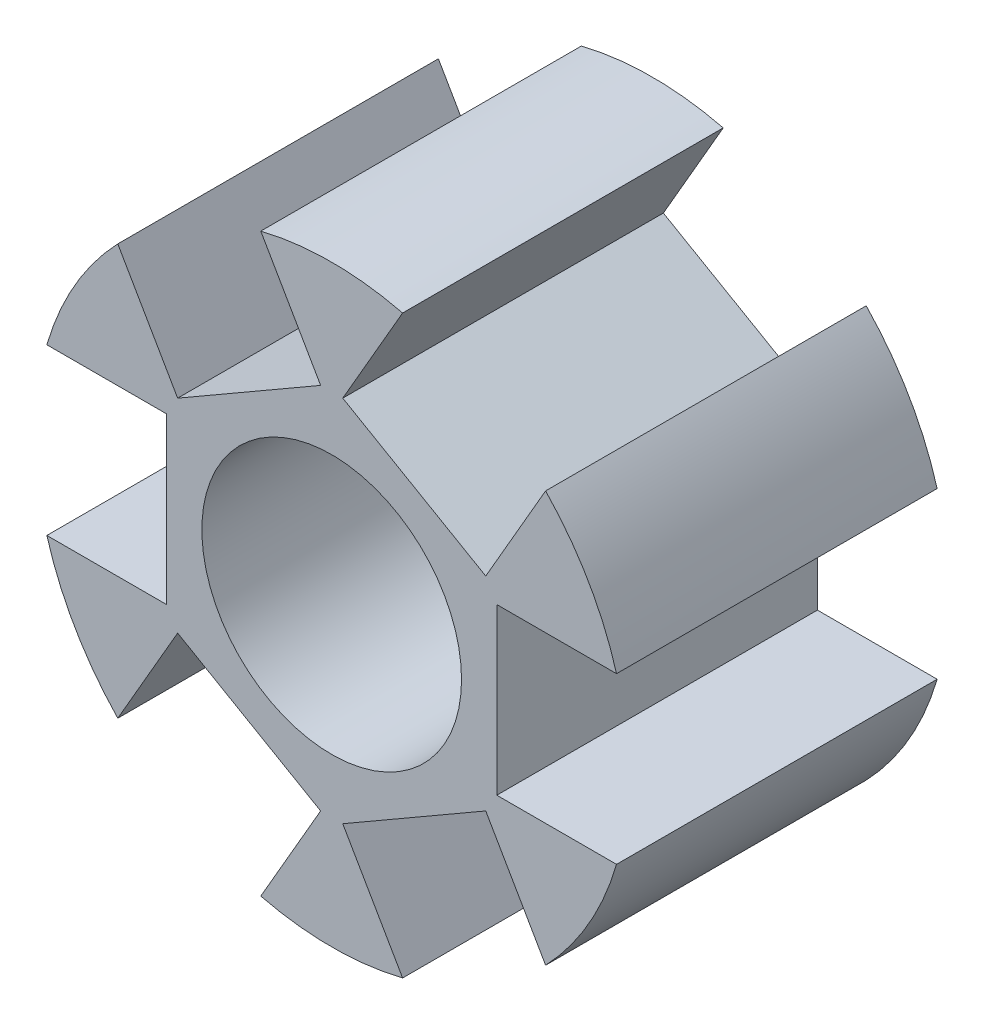
ISO-10303-21;
HEADER;
FILE_DESCRIPTION(('STEP AP214'),'2;1');
FILE_NAME('part.step','',(''),(''),'','','');
FILE_SCHEMA(('AUTOMOTIVE_DESIGN { 1 0 10303 214 1 1 1 1 }'));
ENDSEC;
DATA;
#1=APPLICATION_CONTEXT('core data for automotive mechanical design processes');
#2=APPLICATION_PROTOCOL_DEFINITION('international standard','automotive_design',2000,#1);
#3=PRODUCT_CONTEXT('',#1,'mechanical');
#4=PRODUCT('Part','Part','',(#3));
#5=PRODUCT_RELATED_PRODUCT_CATEGORY('part','',(#4));
#6=PRODUCT_DEFINITION_FORMATION('','',#4);
#7=PRODUCT_DEFINITION_CONTEXT('part definition',#1,'design');
#8=PRODUCT_DEFINITION('design','',#6,#7);
#9=PRODUCT_DEFINITION_SHAPE('','',#8);
#10=(LENGTH_UNIT() NAMED_UNIT(*) SI_UNIT(.MILLI.,.METRE.));
#11=(NAMED_UNIT(*) PLANE_ANGLE_UNIT() SI_UNIT($,.RADIAN.));
#12=(NAMED_UNIT(*) SI_UNIT($,.STERADIAN.) SOLID_ANGLE_UNIT());
#13=UNCERTAINTY_MEASURE_WITH_UNIT(LENGTH_MEASURE(1.E-05),#10,'distance_accuracy_value','');
#14=(GEOMETRIC_REPRESENTATION_CONTEXT(3) GLOBAL_UNCERTAINTY_ASSIGNED_CONTEXT((#13)) GLOBAL_UNIT_ASSIGNED_CONTEXT((#10,
#11,#12)) REPRESENTATION_CONTEXT('',''));
#15=CARTESIAN_POINT('',(0.,0.,0.));
#16=DIRECTION('',(0.,0.,1.));
#17=DIRECTION('',(1.,0.,0.));
#18=AXIS2_PLACEMENT_3D('',#15,#16,#17);
#19=CARTESIAN_POINT('',(0.,0.,5.));
#20=DIRECTION('',(0.,0.,1.));
#21=DIRECTION('',(1.,0.,0.));
#22=AXIS2_PLACEMENT_3D('',#19,#20,#21);
#23=PLANE('',#22);
#24=CARTESIAN_POINT('',(0.,0.,5.));
#25=DIRECTION('',(0.,0.,1.));
#26=DIRECTION('',(1.,0.,0.));
#27=AXIS2_PLACEMENT_3D('',#24,#25,#26);
#28=CIRCLE('',#27,4.05);
#29=CARTESIAN_POINT('',(4.05,0.,5.));
#30=VERTEX_POINT('',#29);
#31=EDGE_CURVE('E337',#30,#30,#28,.T.);
#32=ORIENTED_EDGE('',*,*,#31,.F.);
#33=EDGE_LOOP('',(#32));
#34=FACE_BOUND('',#33,.T.);
#35=DIRECTION('',(-0.866025403784433,-0.50000000000001,0.));
#36=VECTOR('',#35,1.);
#37=CARTESIAN_POINT('',(-0.344984585255135,5.74753082948985,5.));
#38=LINE('',#37,#36);
#39=CARTESIAN_POINT('',(-0.344984585255135,5.74753082948985,5.));
#40=VERTEX_POINT('',#39);
#41=CARTESIAN_POINT('',(-4.80501541474496,3.1725308294898,5.));
#42=VERTEX_POINT('',#41);
#43=EDGE_CURVE('E284',#40,#42,#38,.T.);
#44=ORIENTED_EDGE('',*,*,#43,.T.);
#45=DIRECTION('',(-0.50000000000001,0.866025403784433,0.));
#46=VECTOR('',#45,1.);
#47=CARTESIAN_POINT('',(-4.80501541474496,3.1725308294898,5.));
#48=LINE('',#47,#46);
#49=CARTESIAN_POINT('',(-6.67219604479597,6.40658254764652,5.));
#50=VERTEX_POINT('',#49);
#51=EDGE_CURVE('E289',#42,#50,#48,.T.);
#52=ORIENTED_EDGE('',*,*,#51,.T.);
#53=CARTESIAN_POINT('',(0.,0.,5.));
#54=DIRECTION('',(0.,0.,1.));
#55=DIRECTION('',(1.,0.,0.));
#56=AXIS2_PLACEMENT_3D('',#53,#54,#55);
#57=CIRCLE('',#56,9.25);
#58=CARTESIAN_POINT('',(-8.88436126010193,2.575,5.));
#59=VERTEX_POINT('',#58);
#60=EDGE_CURVE('E350',#50,#59,#57,.T.);
#61=ORIENTED_EDGE('',*,*,#60,.T.);
#62=DIRECTION('',(-1.,0.,0.));
#63=VECTOR('',#62,1.);
#64=CARTESIAN_POINT('',(-5.15,2.575,5.));
#65=LINE('',#64,#63);
#66=CARTESIAN_POINT('',(-5.15,2.575,5.));
#67=VERTEX_POINT('',#66);
#68=EDGE_CURVE('E330',#67,#59,#65,.T.);
#69=ORIENTED_EDGE('',*,*,#68,.F.);
#70=DIRECTION('',(0.,-1.,0.));
#71=VECTOR('',#70,1.);
#72=CARTESIAN_POINT('',(-5.15,2.575,5.));
#73=LINE('',#72,#71);
#74=CARTESIAN_POINT('',(-5.15,-2.575,5.));
#75=VERTEX_POINT('',#74);
#76=EDGE_CURVE('E323',#67,#75,#73,.T.);
#77=ORIENTED_EDGE('',*,*,#76,.T.);
#78=DIRECTION('',(-1.,0.,0.));
#79=VECTOR('',#78,1.);
#80=CARTESIAN_POINT('',(-5.15,-2.575,5.));
#81=LINE('',#80,#79);
#82=CARTESIAN_POINT('',(-8.88436126010193,-2.575,5.));
#83=VERTEX_POINT('',#82);
#84=EDGE_CURVE('E324',#75,#83,#81,.T.);
#85=ORIENTED_EDGE('',*,*,#84,.T.);
#86=CARTESIAN_POINT('',(-6.67219604479588,-6.40658254764661,5.));
#87=VERTEX_POINT('',#86);
#88=EDGE_CURVE('E345',#83,#87,#57,.T.);
#89=ORIENTED_EDGE('',*,*,#88,.T.);
#90=DIRECTION('',(-0.499999999999998,-0.86602540378444,0.));
#91=VECTOR('',#90,1.);
#92=CARTESIAN_POINT('',(-4.80501541474492,-3.17253082948987,5.));
#93=LINE('',#92,#91);
#94=CARTESIAN_POINT('',(-4.80501541474492,-3.17253082948987,5.));
#95=VERTEX_POINT('',#94);
#96=EDGE_CURVE('E306',#95,#87,#93,.T.);
#97=ORIENTED_EDGE('',*,*,#96,.F.);
#98=DIRECTION('',(0.86602540378444,-0.499999999999998,0.));
#99=VECTOR('',#98,1.);
#100=CARTESIAN_POINT('',(-4.80501541474492,-3.17253082948987,5.));
#101=LINE('',#100,#99);
#102=CARTESIAN_POINT('',(-0.344984585255057,-5.74753082948986,5.));
#103=VERTEX_POINT('',#102);
#104=EDGE_CURVE('E297',#95,#103,#101,.T.);
#105=ORIENTED_EDGE('',*,*,#104,.T.);
#106=DIRECTION('',(-0.499999999999998,-0.86602540378444,0.));
#107=VECTOR('',#106,1.);
#108=CARTESIAN_POINT('',(-0.344984585255057,-5.74753082948986,5.));
#109=LINE('',#108,#107);
#110=CARTESIAN_POINT('',(-2.21216521530602,-8.9815825476466,5.));
#111=VERTEX_POINT('',#110);
#112=EDGE_CURVE('E303',#103,#111,#109,.T.);
#113=ORIENTED_EDGE('',*,*,#112,.T.);
#114=CARTESIAN_POINT('',(2.21216521530608,-8.98158254764659,5.));
#115=VERTEX_POINT('',#114);
#116=EDGE_CURVE('E346',#111,#115,#57,.T.);
#117=ORIENTED_EDGE('',*,*,#116,.T.);
#118=DIRECTION('',(0.500000000000004,-0.866025403784436,0.));
#119=VECTOR('',#118,1.);
#120=CARTESIAN_POINT('',(0.344984585255095,-5.74753082948986,5.));
#121=LINE('',#120,#119);
#122=CARTESIAN_POINT('',(0.344984585255095,-5.74753082948986,5.));
#123=VERTEX_POINT('',#122);
#124=EDGE_CURVE('E231',#123,#115,#121,.T.);
#125=ORIENTED_EDGE('',*,*,#124,.F.);
#126=DIRECTION('',(0.866025403784436,0.500000000000004,0.));
#127=VECTOR('',#126,1.);
#128=CARTESIAN_POINT('',(0.344984585255095,-5.74753082948986,5.));
#129=LINE('',#128,#127);
#130=CARTESIAN_POINT('',(4.80501541474494,-3.17253082948984,5.));
#131=VERTEX_POINT('',#130);
#132=EDGE_CURVE('E518',#123,#131,#129,.T.);
#133=ORIENTED_EDGE('',*,*,#132,.T.);
#134=DIRECTION('',(0.500000000000004,-0.866025403784436,0.));
#135=VECTOR('',#134,1.);
#136=CARTESIAN_POINT('',(4.80501541474494,-3.17253082948984,5.));
#137=LINE('',#136,#135);
#138=CARTESIAN_POINT('',(6.67219604479592,-6.40658254764657,5.));
#139=VERTEX_POINT('',#138);
#140=EDGE_CURVE('E217',#131,#139,#137,.T.);
#141=ORIENTED_EDGE('',*,*,#140,.T.);
#142=CARTESIAN_POINT('',(8.88436126010193,-2.575,5.));
#143=VERTEX_POINT('',#142);
#144=EDGE_CURVE('E430',#139,#143,#57,.T.);
#145=ORIENTED_EDGE('',*,*,#144,.T.);
#146=DIRECTION('',(1.,0.,0.));
#147=VECTOR('',#146,1.);
#148=CARTESIAN_POINT('',(5.15,-2.575,5.));
#149=LINE('',#148,#147);
#150=CARTESIAN_POINT('',(5.15,-2.575,5.));
#151=VERTEX_POINT('',#150);
#152=EDGE_CURVE('E255',#151,#143,#149,.T.);
#153=ORIENTED_EDGE('',*,*,#152,.F.);
#154=DIRECTION('',(0.,1.,0.));
#155=VECTOR('',#154,1.);
#156=CARTESIAN_POINT('',(5.15,-2.575,5.));
#157=LINE('',#156,#155);
#158=CARTESIAN_POINT('',(5.15,2.575,5.));
#159=VERTEX_POINT('',#158);
#160=EDGE_CURVE('E246',#151,#159,#157,.T.);
#161=ORIENTED_EDGE('',*,*,#160,.T.);
#162=DIRECTION('',(1.,0.,0.));
#163=VECTOR('',#162,1.);
#164=CARTESIAN_POINT('',(5.15,2.575,5.));
#165=LINE('',#164,#163);
#166=CARTESIAN_POINT('',(8.88436126010193,2.575,5.));
#167=VERTEX_POINT('',#166);
#168=EDGE_CURVE('E248',#159,#167,#165,.T.);
#169=ORIENTED_EDGE('',*,*,#168,.T.);
#170=CARTESIAN_POINT('',(6.67219604479584,6.40658254764666,5.));
#171=VERTEX_POINT('',#170);
#172=EDGE_CURVE('E429',#167,#171,#57,.T.);
#173=ORIENTED_EDGE('',*,*,#172,.T.);
#174=DIRECTION('',(0.499999999999992,0.866025403784443,0.));
#175=VECTOR('',#174,1.);
#176=CARTESIAN_POINT('',(4.8050154147449,3.1725308294899,5.));
#177=LINE('',#176,#175);
#178=CARTESIAN_POINT('',(4.8050154147449,3.1725308294899,5.));
#179=VERTEX_POINT('',#178);
#180=EDGE_CURVE('E64',#179,#171,#177,.T.);
#181=ORIENTED_EDGE('',*,*,#180,.F.);
#182=DIRECTION('',(-0.866025403784443,0.499999999999992,0.));
#183=VECTOR('',#182,1.);
#184=CARTESIAN_POINT('',(4.8050154147449,3.1725308294899,5.));
#185=LINE('',#184,#183);
#186=CARTESIAN_POINT('',(0.344984585255016,5.74753082948986,5.));
#187=VERTEX_POINT('',#186);
#188=EDGE_CURVE('E267',#179,#187,#185,.T.);
#189=ORIENTED_EDGE('',*,*,#188,.T.);
#190=DIRECTION('',(0.499999999999992,0.866025403784443,0.));
#191=VECTOR('',#190,1.);
#192=CARTESIAN_POINT('',(0.344984585255016,5.74753082948986,5.));
#193=LINE('',#192,#191);
#194=CARTESIAN_POINT('',(2.21216521530595,8.98158254764662,5.));
#195=VERTEX_POINT('',#194);
#196=EDGE_CURVE('E266',#187,#195,#193,.T.);
#197=ORIENTED_EDGE('',*,*,#196,.T.);
#198=CARTESIAN_POINT('',(-2.21216521530614,8.98158254764657,5.));
#199=VERTEX_POINT('',#198);
#200=EDGE_CURVE('E433',#195,#199,#57,.T.);
#201=ORIENTED_EDGE('',*,*,#200,.T.);
#202=DIRECTION('',(-0.50000000000001,0.866025403784433,0.));
#203=VECTOR('',#202,1.);
#204=CARTESIAN_POINT('',(-0.344984585255135,5.74753082948985,5.));
#205=LINE('',#204,#203);
#206=EDGE_CURVE('E57',#40,#199,#205,.T.);
#207=ORIENTED_EDGE('',*,*,#206,.F.);
#208=EDGE_LOOP('',(#44,#52,#61,#69,#77,#85,#89,#97,#105,#113,#117,#125,#133,#141,#145,#153,#161,
#169,#173,#181,#189,#197,#201,#207));
#209=FACE_BOUND('',#208,.T.);
#210=ADVANCED_FACE('F41',(#34,#209),#23,.T.);
#211=CARTESIAN_POINT('',(0.,0.,-5.));
#212=DIRECTION('',(0.,0.,1.));
#213=DIRECTION('',(1.,0.,0.));
#214=AXIS2_PLACEMENT_3D('',#211,#212,#213);
#215=PLANE('',#214);
#216=CARTESIAN_POINT('',(0.,0.,-5.));
#217=DIRECTION('',(0.,0.,1.));
#218=DIRECTION('',(1.,0.,0.));
#219=AXIS2_PLACEMENT_3D('',#216,#217,#218);
#220=CIRCLE('',#219,4.05);
#221=CARTESIAN_POINT('',(4.05,0.,-5.));
#222=VERTEX_POINT('',#221);
#223=EDGE_CURVE('E333',#222,#222,#220,.T.);
#224=ORIENTED_EDGE('',*,*,#223,.T.);
#225=EDGE_LOOP('',(#224));
#226=FACE_BOUND('',#225,.T.);
#227=DIRECTION('',(-0.50000000000001,0.866025403784433,0.));
#228=VECTOR('',#227,1.);
#229=CARTESIAN_POINT('',(-4.80501541474496,3.1725308294898,-5.));
#230=LINE('',#229,#228);
#231=CARTESIAN_POINT('',(-4.80501541474496,3.1725308294898,-5.));
#232=VERTEX_POINT('',#231);
#233=CARTESIAN_POINT('',(-6.67219604479597,6.40658254764652,-5.));
#234=VERTEX_POINT('',#233);
#235=EDGE_CURVE('E261',#232,#234,#230,.T.);
#236=ORIENTED_EDGE('',*,*,#235,.F.);
#237=DIRECTION('',(0.866025403784433,0.50000000000001,0.));
#238=VECTOR('',#237,1.);
#239=CARTESIAN_POINT('',(-0.344984585255135,5.74753082948985,-5.));
#240=LINE('',#239,#238);
#241=CARTESIAN_POINT('',(-0.344984585255135,5.74753082948985,-5.));
#242=VERTEX_POINT('',#241);
#243=EDGE_CURVE('E277',#232,#242,#240,.T.);
#244=ORIENTED_EDGE('',*,*,#243,.T.);
#245=DIRECTION('',(-0.50000000000001,0.866025403784433,0.));
#246=VECTOR('',#245,1.);
#247=CARTESIAN_POINT('',(-0.344984585255135,5.74753082948985,-5.));
#248=LINE('',#247,#246);
#249=CARTESIAN_POINT('',(-2.21216521530614,8.98158254764657,-5.));
#250=VERTEX_POINT('',#249);
#251=EDGE_CURVE('E292',#242,#250,#248,.T.);
#252=ORIENTED_EDGE('',*,*,#251,.T.);
#253=CARTESIAN_POINT('',(0.,0.,-5.));
#254=DIRECTION('',(0.,0.,1.));
#255=DIRECTION('',(1.,0.,0.));
#256=AXIS2_PLACEMENT_3D('',#253,#254,#255);
#257=CIRCLE('',#256,9.25);
#258=CARTESIAN_POINT('',(2.21216521530595,8.98158254764662,-5.));
#259=VERTEX_POINT('',#258);
#260=EDGE_CURVE('E378',#259,#250,#257,.T.);
#261=ORIENTED_EDGE('',*,*,#260,.F.);
#262=DIRECTION('',(0.499999999999992,0.866025403784443,0.));
#263=VECTOR('',#262,1.);
#264=CARTESIAN_POINT('',(0.344984585255016,5.74753082948986,-5.));
#265=LINE('',#264,#263);
#266=CARTESIAN_POINT('',(0.344984585255016,5.74753082948986,-5.));
#267=VERTEX_POINT('',#266);
#268=EDGE_CURVE('E241',#267,#259,#265,.T.);
#269=ORIENTED_EDGE('',*,*,#268,.F.);
#270=DIRECTION('',(0.866025403784443,-0.499999999999992,0.));
#271=VECTOR('',#270,1.);
#272=CARTESIAN_POINT('',(4.8050154147449,3.1725308294899,-5.));
#273=LINE('',#272,#271);
#274=CARTESIAN_POINT('',(4.8050154147449,3.1725308294899,-5.));
#275=VERTEX_POINT('',#274);
#276=EDGE_CURVE('E257',#267,#275,#273,.T.);
#277=ORIENTED_EDGE('',*,*,#276,.T.);
#278=DIRECTION('',(0.499999999999992,0.866025403784443,0.));
#279=VECTOR('',#278,1.);
#280=CARTESIAN_POINT('',(4.8050154147449,3.1725308294899,-5.));
#281=LINE('',#280,#279);
#282=CARTESIAN_POINT('',(6.67219604479584,6.40658254764666,-5.));
#283=VERTEX_POINT('',#282);
#284=EDGE_CURVE('E271',#275,#283,#281,.T.);
#285=ORIENTED_EDGE('',*,*,#284,.T.);
#286=CARTESIAN_POINT('',(8.88436126010193,2.575,-5.));
#287=VERTEX_POINT('',#286);
#288=EDGE_CURVE('E385',#287,#283,#257,.T.);
#289=ORIENTED_EDGE('',*,*,#288,.F.);
#290=DIRECTION('',(1.,0.,0.));
#291=VECTOR('',#290,1.);
#292=CARTESIAN_POINT('',(5.15,2.575,-5.));
#293=LINE('',#292,#291);
#294=CARTESIAN_POINT('',(5.15,2.575,-5.));
#295=VERTEX_POINT('',#294);
#296=EDGE_CURVE('E218',#295,#287,#293,.T.);
#297=ORIENTED_EDGE('',*,*,#296,.F.);
#298=DIRECTION('',(0.,-1.,0.));
#299=VECTOR('',#298,1.);
#300=CARTESIAN_POINT('',(5.15,-2.575,-5.));
#301=LINE('',#300,#299);
#302=CARTESIAN_POINT('',(5.15,-2.575,-5.));
#303=VERTEX_POINT('',#302);
#304=EDGE_CURVE('E239',#295,#303,#301,.T.);
#305=ORIENTED_EDGE('',*,*,#304,.T.);
#306=DIRECTION('',(1.,0.,0.));
#307=VECTOR('',#306,1.);
#308=CARTESIAN_POINT('',(5.15,-2.575,-5.));
#309=LINE('',#308,#307);
#310=CARTESIAN_POINT('',(8.88436126010193,-2.575,-5.));
#311=VERTEX_POINT('',#310);
#312=EDGE_CURVE('E251',#303,#311,#309,.T.);
#313=ORIENTED_EDGE('',*,*,#312,.T.);
#314=CARTESIAN_POINT('',(6.67219604479592,-6.40658254764657,-5.));
#315=VERTEX_POINT('',#314);
#316=EDGE_CURVE('E228',#315,#311,#257,.T.);
#317=ORIENTED_EDGE('',*,*,#316,.F.);
#318=DIRECTION('',(0.500000000000004,-0.866025403784436,0.));
#319=VECTOR('',#318,1.);
#320=CARTESIAN_POINT('',(4.80501541474494,-3.17253082948984,-5.));
#321=LINE('',#320,#319);
#322=CARTESIAN_POINT('',(4.80501541474494,-3.17253082948984,-5.));
#323=VERTEX_POINT('',#322);
#324=EDGE_CURVE('E212',#323,#315,#321,.T.);
#325=ORIENTED_EDGE('',*,*,#324,.F.);
#326=DIRECTION('',(-0.866025403784436,-0.500000000000004,0.));
#327=VECTOR('',#326,1.);
#328=CARTESIAN_POINT('',(0.344984585255095,-5.74753082948986,-5.));
#329=LINE('',#328,#327);
#330=CARTESIAN_POINT('',(0.344984585255095,-5.74753082948986,-5.));
#331=VERTEX_POINT('',#330);
#332=EDGE_CURVE('E205',#323,#331,#329,.T.);
#333=ORIENTED_EDGE('',*,*,#332,.T.);
#334=DIRECTION('',(0.500000000000004,-0.866025403784436,0.));
#335=VECTOR('',#334,1.);
#336=CARTESIAN_POINT('',(0.344984585255095,-5.74753082948986,-5.));
#337=LINE('',#336,#335);
#338=CARTESIAN_POINT('',(2.21216521530608,-8.98158254764659,-5.));
#339=VERTEX_POINT('',#338);
#340=EDGE_CURVE('E226',#331,#339,#337,.T.);
#341=ORIENTED_EDGE('',*,*,#340,.T.);
#342=CARTESIAN_POINT('',(-2.21216521530602,-8.9815825476466,-5.));
#343=VERTEX_POINT('',#342);
#344=EDGE_CURVE('E352',#343,#339,#257,.T.);
#345=ORIENTED_EDGE('',*,*,#344,.F.);
#346=DIRECTION('',(-0.499999999999998,-0.86602540378444,0.));
#347=VECTOR('',#346,1.);
#348=CARTESIAN_POINT('',(-0.344984585255057,-5.74753082948986,-5.));
#349=LINE('',#348,#347);
#350=CARTESIAN_POINT('',(-0.344984585255057,-5.74753082948986,-5.));
#351=VERTEX_POINT('',#350);
#352=EDGE_CURVE('E311',#351,#343,#349,.T.);
#353=ORIENTED_EDGE('',*,*,#352,.F.);
#354=DIRECTION('',(-0.86602540378444,0.499999999999998,0.));
#355=VECTOR('',#354,1.);
#356=CARTESIAN_POINT('',(-4.80501541474492,-3.17253082948987,-5.));
#357=LINE('',#356,#355);
#358=CARTESIAN_POINT('',(-4.80501541474492,-3.17253082948987,-5.));
#359=VERTEX_POINT('',#358);
#360=EDGE_CURVE('E233',#351,#359,#357,.T.);
#361=ORIENTED_EDGE('',*,*,#360,.T.);
#362=DIRECTION('',(-0.499999999999998,-0.86602540378444,0.));
#363=VECTOR('',#362,1.);
#364=CARTESIAN_POINT('',(-4.80501541474492,-3.17253082948987,-5.));
#365=LINE('',#364,#363);
#366=CARTESIAN_POINT('',(-6.67219604479588,-6.40658254764661,-5.));
#367=VERTEX_POINT('',#366);
#368=EDGE_CURVE('E308',#359,#367,#365,.T.);
#369=ORIENTED_EDGE('',*,*,#368,.T.);
#370=CARTESIAN_POINT('',(-8.88436126010193,-2.575,-5.));
#371=VERTEX_POINT('',#370);
#372=EDGE_CURVE('E347',#371,#367,#257,.T.);
#373=ORIENTED_EDGE('',*,*,#372,.F.);
#374=DIRECTION('',(-1.,0.,0.));
#375=VECTOR('',#374,1.);
#376=CARTESIAN_POINT('',(-5.15,-2.575,-5.));
#377=LINE('',#376,#375);
#378=CARTESIAN_POINT('',(-5.15,-2.575,-5.));
#379=VERTEX_POINT('',#378);
#380=EDGE_CURVE('E334',#379,#371,#377,.T.);
#381=ORIENTED_EDGE('',*,*,#380,.F.);
#382=DIRECTION('',(0.,1.,0.));
#383=VECTOR('',#382,1.);
#384=CARTESIAN_POINT('',(-5.15,2.575,-5.));
#385=LINE('',#384,#383);
#386=CARTESIAN_POINT('',(-5.15,2.575,-5.));
#387=VERTEX_POINT('',#386);
#388=EDGE_CURVE('E317',#379,#387,#385,.T.);
#389=ORIENTED_EDGE('',*,*,#388,.T.);
#390=DIRECTION('',(-1.,0.,0.));
#391=VECTOR('',#390,1.);
#392=CARTESIAN_POINT('',(-5.15,2.575,-5.));
#393=LINE('',#392,#391);
#394=CARTESIAN_POINT('',(-8.88436126010193,2.575,-5.));
#395=VERTEX_POINT('',#394);
#396=EDGE_CURVE('E329',#387,#395,#393,.T.);
#397=ORIENTED_EDGE('',*,*,#396,.T.);
#398=EDGE_CURVE('E339',#234,#395,#257,.T.);
#399=ORIENTED_EDGE('',*,*,#398,.F.);
#400=EDGE_LOOP('',(#236,#244,#252,#261,#269,#277,#285,#289,#297,#305,#313,#317,#325,#333,#341,
#345,#353,#361,#369,#373,#381,#389,#397,#399));
#401=FACE_BOUND('',#400,.T.);
#402=ADVANCED_FACE('F224',(#226,#401),#215,.F.);
#403=CARTESIAN_POINT('',(0.,0.,5.));
#404=DIRECTION('',(0.,0.,-1.));
#405=DIRECTION('',(-1.,0.,0.));
#406=AXIS2_PLACEMENT_3D('',#403,#404,#405);
#407=CYLINDRICAL_SURFACE('',#406,9.25);
#408=DIRECTION('',(0.,0.,-1.));
#409=VECTOR('',#408,1.);
#410=CARTESIAN_POINT('',(-6.67219604479597,6.40658254764652,5.));
#411=LINE('',#410,#409);
#412=EDGE_CURVE('E11',#234,#50,#411,.F.);
#413=ORIENTED_EDGE('',*,*,#412,.F.);
#414=ORIENTED_EDGE('',*,*,#398,.T.);
#415=DIRECTION('',(0.,0.,-1.));
#416=VECTOR('',#415,1.);
#417=CARTESIAN_POINT('',(-8.88436126010193,2.575,5.));
#418=LINE('',#417,#416);
#419=EDGE_CURVE('E342',#59,#395,#418,.T.);
#420=ORIENTED_EDGE('',*,*,#419,.F.);
#421=ORIENTED_EDGE('',*,*,#60,.F.);
#422=EDGE_LOOP('',(#413,#414,#420,#421));
#423=FACE_BOUND('',#422,.T.);
#424=ADVANCED_FACE('F43',(#423),#407,.T.);
#425=DIRECTION('',(0.,0.,-1.));
#426=VECTOR('',#425,1.);
#427=CARTESIAN_POINT('',(-2.21216521530614,8.98158254764657,5.));
#428=LINE('',#427,#426);
#429=EDGE_CURVE('E47',#199,#250,#428,.T.);
#430=ORIENTED_EDGE('',*,*,#429,.F.);
#431=ORIENTED_EDGE('',*,*,#200,.F.);
#432=DIRECTION('',(0.,0.,-1.));
#433=VECTOR('',#432,1.);
#434=CARTESIAN_POINT('',(2.21216521530595,8.98158254764662,5.));
#435=LINE('',#434,#433);
#436=EDGE_CURVE('E369',#259,#195,#435,.F.);
#437=ORIENTED_EDGE('',*,*,#436,.F.);
#438=ORIENTED_EDGE('',*,*,#260,.T.);
#439=EDGE_LOOP('',(#430,#431,#437,#438));
#440=FACE_BOUND('',#439,.T.);
#441=ADVANCED_FACE('F382',(#440),#407,.T.);
#442=DIRECTION('',(0.,0.,-1.));
#443=VECTOR('',#442,1.);
#444=CARTESIAN_POINT('',(6.67219604479584,6.40658254764666,5.));
#445=LINE('',#444,#443);
#446=EDGE_CURVE('E368',#171,#283,#445,.T.);
#447=ORIENTED_EDGE('',*,*,#446,.F.);
#448=ORIENTED_EDGE('',*,*,#172,.F.);
#449=DIRECTION('',(0.,0.,-1.));
#450=VECTOR('',#449,1.);
#451=CARTESIAN_POINT('',(8.88436126010193,2.575,5.));
#452=LINE('',#451,#450);
#453=EDGE_CURVE('E366',#287,#167,#452,.F.);
#454=ORIENTED_EDGE('',*,*,#453,.F.);
#455=ORIENTED_EDGE('',*,*,#288,.T.);
#456=EDGE_LOOP('',(#447,#448,#454,#455));
#457=FACE_BOUND('',#456,.T.);
#458=ADVANCED_FACE('F504',(#457),#407,.T.);
#459=DIRECTION('',(0.,0.,-1.));
#460=VECTOR('',#459,1.);
#461=CARTESIAN_POINT('',(8.88436126010193,-2.575,5.));
#462=LINE('',#461,#460);
#463=EDGE_CURVE('E364',#143,#311,#462,.T.);
#464=ORIENTED_EDGE('',*,*,#463,.F.);
#465=ORIENTED_EDGE('',*,*,#144,.F.);
#466=DIRECTION('',(0.,0.,-1.));
#467=VECTOR('',#466,1.);
#468=CARTESIAN_POINT('',(6.67219604479592,-6.40658254764657,5.));
#469=LINE('',#468,#467);
#470=EDGE_CURVE('E365',#315,#139,#469,.F.);
#471=ORIENTED_EDGE('',*,*,#470,.F.);
#472=ORIENTED_EDGE('',*,*,#316,.T.);
#473=EDGE_LOOP('',(#464,#465,#471,#472));
#474=FACE_BOUND('',#473,.T.);
#475=ADVANCED_FACE('F514',(#474),#407,.T.);
#476=DIRECTION('',(0.,0.,-1.));
#477=VECTOR('',#476,1.);
#478=CARTESIAN_POINT('',(2.21216521530608,-8.98158254764659,5.));
#479=LINE('',#478,#477);
#480=EDGE_CURVE('E359',#115,#339,#479,.T.);
#481=ORIENTED_EDGE('',*,*,#480,.F.);
#482=ORIENTED_EDGE('',*,*,#116,.F.);
#483=DIRECTION('',(0.,0.,-1.));
#484=VECTOR('',#483,1.);
#485=CARTESIAN_POINT('',(-2.21216521530602,-8.9815825476466,5.));
#486=LINE('',#485,#484);
#487=EDGE_CURVE('E356',#343,#111,#486,.F.);
#488=ORIENTED_EDGE('',*,*,#487,.F.);
#489=ORIENTED_EDGE('',*,*,#344,.T.);
#490=EDGE_LOOP('',(#481,#482,#488,#489));
#491=FACE_BOUND('',#490,.T.);
#492=ADVANCED_FACE('F424',(#491),#407,.T.);
#493=DIRECTION('',(0.,0.,-1.));
#494=VECTOR('',#493,1.);
#495=CARTESIAN_POINT('',(-6.67219604479588,-6.40658254764661,5.));
#496=LINE('',#495,#494);
#497=EDGE_CURVE('E358',#87,#367,#496,.T.);
#498=ORIENTED_EDGE('',*,*,#497,.F.);
#499=ORIENTED_EDGE('',*,*,#88,.F.);
#500=DIRECTION('',(0.,0.,-1.));
#501=VECTOR('',#500,1.);
#502=CARTESIAN_POINT('',(-8.88436126010193,-2.575,5.));
#503=LINE('',#502,#501);
#504=EDGE_CURVE('E351',#371,#83,#503,.F.);
#505=ORIENTED_EDGE('',*,*,#504,.F.);
#506=ORIENTED_EDGE('',*,*,#372,.T.);
#507=EDGE_LOOP('',(#498,#499,#505,#506));
#508=FACE_BOUND('',#507,.T.);
#509=ADVANCED_FACE('F410',(#508),#407,.T.);
#510=CARTESIAN_POINT('',(0.,0.,5.));
#511=DIRECTION('',(0.,0.,-1.));
#512=DIRECTION('',(-1.,0.,0.));
#513=AXIS2_PLACEMENT_3D('',#510,#511,#512);
#514=CYLINDRICAL_SURFACE('',#513,4.05);
#515=ORIENTED_EDGE('',*,*,#31,.T.);
#516=EDGE_LOOP('',(#515));
#517=FACE_BOUND('',#516,.T.);
#518=ORIENTED_EDGE('',*,*,#223,.F.);
#519=EDGE_LOOP('',(#518));
#520=FACE_BOUND('',#519,.T.);
#521=ADVANCED_FACE('F457',(#517,#520),#514,.F.);
#522=CARTESIAN_POINT('',(-5.15,-2.575,5.));
#523=DIRECTION('',(0.,1.,0.));
#524=DIRECTION('',(0.,0.,1.));
#525=AXIS2_PLACEMENT_3D('',#522,#523,#524);
#526=PLANE('',#525);
#527=ORIENTED_EDGE('',*,*,#504,.T.);
#528=ORIENTED_EDGE('',*,*,#84,.F.);
#529=DIRECTION('',(0.,0.,-1.));
#530=VECTOR('',#529,1.);
#531=CARTESIAN_POINT('',(-5.15,-2.575,5.));
#532=LINE('',#531,#530);
#533=EDGE_CURVE('E312',#75,#379,#532,.T.);
#534=ORIENTED_EDGE('',*,*,#533,.T.);
#535=ORIENTED_EDGE('',*,*,#380,.T.);
#536=EDGE_LOOP('',(#527,#528,#534,#535));
#537=FACE_BOUND('',#536,.T.);
#538=ADVANCED_FACE('F398',(#537),#526,.T.);
#539=CARTESIAN_POINT('',(-5.15,2.575,5.));
#540=DIRECTION('',(0.,-1.,0.));
#541=DIRECTION('',(0.,0.,-1.));
#542=AXIS2_PLACEMENT_3D('',#539,#540,#541);
#543=PLANE('',#542);
#544=ORIENTED_EDGE('',*,*,#419,.T.);
#545=ORIENTED_EDGE('',*,*,#396,.F.);
#546=DIRECTION('',(0.,0.,1.));
#547=VECTOR('',#546,1.);
#548=CARTESIAN_POINT('',(-5.15,2.575,5.));
#549=LINE('',#548,#547);
#550=EDGE_CURVE('E316',#387,#67,#549,.T.);
#551=ORIENTED_EDGE('',*,*,#550,.T.);
#552=ORIENTED_EDGE('',*,*,#68,.T.);
#553=EDGE_LOOP('',(#544,#545,#551,#552));
#554=FACE_BOUND('',#553,.T.);
#555=ADVANCED_FACE('F387',(#554),#543,.T.);
#556=CARTESIAN_POINT('',(-5.15,0.,0.));
#557=DIRECTION('',(-1.,0.,0.));
#558=DIRECTION('',(0.,0.,1.));
#559=AXIS2_PLACEMENT_3D('',#556,#557,#558);
#560=PLANE('',#559);
#561=ORIENTED_EDGE('',*,*,#533,.F.);
#562=ORIENTED_EDGE('',*,*,#76,.F.);
#563=ORIENTED_EDGE('',*,*,#550,.F.);
#564=ORIENTED_EDGE('',*,*,#388,.F.);
#565=EDGE_LOOP('',(#561,#562,#563,#564));
#566=FACE_BOUND('',#565,.T.);
#567=ADVANCED_FACE('F400',(#566),#560,.T.);
#568=CARTESIAN_POINT('',(-0.344984585255057,-5.74753082948986,5.));
#569=DIRECTION('',(-0.86602540378444,0.499999999999998,0.));
#570=DIRECTION('',(-0.499999999999998,-0.86602540378444,0.));
#571=AXIS2_PLACEMENT_3D('',#568,#569,#570);
#572=PLANE('',#571);
#573=ORIENTED_EDGE('',*,*,#487,.T.);
#574=ORIENTED_EDGE('',*,*,#112,.F.);
#575=DIRECTION('',(0.,0.,-1.));
#576=VECTOR('',#575,1.);
#577=CARTESIAN_POINT('',(-0.344984585255057,-5.74753082948986,5.));
#578=LINE('',#577,#576);
#579=EDGE_CURVE('E227',#103,#351,#578,.T.);
#580=ORIENTED_EDGE('',*,*,#579,.T.);
#581=ORIENTED_EDGE('',*,*,#352,.T.);
#582=EDGE_LOOP('',(#573,#574,#580,#581));
#583=FACE_BOUND('',#582,.T.);
#584=ADVANCED_FACE('F419',(#583),#572,.T.);
#585=CARTESIAN_POINT('',(-4.80501541474492,-3.17253082948987,5.));
#586=DIRECTION('',(0.86602540378444,-0.499999999999998,0.));
#587=DIRECTION('',(0.499999999999998,0.86602540378444,0.));
#588=AXIS2_PLACEMENT_3D('',#585,#586,#587);
#589=PLANE('',#588);
#590=ORIENTED_EDGE('',*,*,#497,.T.);
#591=ORIENTED_EDGE('',*,*,#368,.F.);
#592=DIRECTION('',(0.,0.,1.));
#593=VECTOR('',#592,1.);
#594=CARTESIAN_POINT('',(-4.80501541474492,-3.17253082948987,5.));
#595=LINE('',#594,#593);
#596=EDGE_CURVE('E296',#359,#95,#595,.T.);
#597=ORIENTED_EDGE('',*,*,#596,.T.);
#598=ORIENTED_EDGE('',*,*,#96,.T.);
#599=EDGE_LOOP('',(#590,#591,#597,#598));
#600=FACE_BOUND('',#599,.T.);
#601=ADVANCED_FACE('F409',(#600),#589,.T.);
#602=CARTESIAN_POINT('',(-2.57499999999999,-4.46003082948986,0.));
#603=DIRECTION('',(-0.499999999999998,-0.86602540378444,0.));
#604=DIRECTION('',(0.,0.,1.));
#605=AXIS2_PLACEMENT_3D('',#602,#603,#604);
#606=PLANE('',#605);
#607=ORIENTED_EDGE('',*,*,#579,.F.);
#608=ORIENTED_EDGE('',*,*,#104,.F.);
#609=ORIENTED_EDGE('',*,*,#596,.F.);
#610=ORIENTED_EDGE('',*,*,#360,.F.);
#611=EDGE_LOOP('',(#607,#608,#609,#610));
#612=FACE_BOUND('',#611,.T.);
#613=ADVANCED_FACE('F414',(#612),#606,.T.);
#614=CARTESIAN_POINT('',(4.80501541474494,-3.17253082948984,5.));
#615=DIRECTION('',(-0.866025403784436,-0.500000000000004,0.));
#616=DIRECTION('',(0.500000000000004,-0.866025403784436,0.));
#617=AXIS2_PLACEMENT_3D('',#614,#615,#616);
#618=PLANE('',#617);
#619=ORIENTED_EDGE('',*,*,#470,.T.);
#620=ORIENTED_EDGE('',*,*,#140,.F.);
#621=DIRECTION('',(0.,0.,-1.));
#622=VECTOR('',#621,1.);
#623=CARTESIAN_POINT('',(4.80501541474494,-3.17253082948984,5.));
#624=LINE('',#623,#622);
#625=EDGE_CURVE('E207',#131,#323,#624,.T.);
#626=ORIENTED_EDGE('',*,*,#625,.T.);
#627=ORIENTED_EDGE('',*,*,#324,.T.);
#628=EDGE_LOOP('',(#619,#620,#626,#627));
#629=FACE_BOUND('',#628,.T.);
#630=ADVANCED_FACE('F214',(#629),#618,.T.);
#631=CARTESIAN_POINT('',(0.344984585255095,-5.74753082948986,5.));
#632=DIRECTION('',(0.866025403784436,0.500000000000004,0.));
#633=DIRECTION('',(-0.500000000000004,0.866025403784436,0.));
#634=AXIS2_PLACEMENT_3D('',#631,#632,#633);
#635=PLANE('',#634);
#636=ORIENTED_EDGE('',*,*,#480,.T.);
#637=ORIENTED_EDGE('',*,*,#340,.F.);
#638=DIRECTION('',(0.,0.,1.));
#639=VECTOR('',#638,1.);
#640=CARTESIAN_POINT('',(0.344984585255095,-5.74753082948986,5.));
#641=LINE('',#640,#639);
#642=EDGE_CURVE('E206',#331,#123,#641,.T.);
#643=ORIENTED_EDGE('',*,*,#642,.T.);
#644=ORIENTED_EDGE('',*,*,#124,.T.);
#645=EDGE_LOOP('',(#636,#637,#643,#644));
#646=FACE_BOUND('',#645,.T.);
#647=ADVANCED_FACE('F513',(#646),#635,.T.);
#648=CARTESIAN_POINT('',(2.57500000000002,-4.46003082948985,0.));
#649=DIRECTION('',(0.500000000000004,-0.866025403784436,0.));
#650=DIRECTION('',(0.,0.,1.));
#651=AXIS2_PLACEMENT_3D('',#648,#649,#650);
#652=PLANE('',#651);
#653=ORIENTED_EDGE('',*,*,#625,.F.);
#654=ORIENTED_EDGE('',*,*,#132,.F.);
#655=ORIENTED_EDGE('',*,*,#642,.F.);
#656=ORIENTED_EDGE('',*,*,#332,.F.);
#657=EDGE_LOOP('',(#653,#654,#655,#656));
#658=FACE_BOUND('',#657,.T.);
#659=ADVANCED_FACE('F201',(#658),#652,.T.);
#660=CARTESIAN_POINT('',(5.15,2.575,5.));
#661=DIRECTION('',(0.,-1.,0.));
#662=DIRECTION('',(0.,0.,-1.));
#663=AXIS2_PLACEMENT_3D('',#660,#661,#662);
#664=PLANE('',#663);
#665=ORIENTED_EDGE('',*,*,#453,.T.);
#666=ORIENTED_EDGE('',*,*,#168,.F.);
#667=DIRECTION('',(0.,0.,-1.));
#668=VECTOR('',#667,1.);
#669=CARTESIAN_POINT('',(5.15,2.575,5.));
#670=LINE('',#669,#668);
#671=EDGE_CURVE('E240',#159,#295,#670,.T.);
#672=ORIENTED_EDGE('',*,*,#671,.T.);
#673=ORIENTED_EDGE('',*,*,#296,.T.);
#674=EDGE_LOOP('',(#665,#666,#672,#673));
#675=FACE_BOUND('',#674,.T.);
#676=ADVANCED_FACE('F486',(#675),#664,.T.);
#677=CARTESIAN_POINT('',(5.15,-2.575,5.));
#678=DIRECTION('',(0.,1.,0.));
#679=DIRECTION('',(0.,0.,1.));
#680=AXIS2_PLACEMENT_3D('',#677,#678,#679);
#681=PLANE('',#680);
#682=ORIENTED_EDGE('',*,*,#463,.T.);
#683=ORIENTED_EDGE('',*,*,#312,.F.);
#684=DIRECTION('',(0.,0.,1.));
#685=VECTOR('',#684,1.);
#686=CARTESIAN_POINT('',(5.15,-2.575,5.));
#687=LINE('',#686,#685);
#688=EDGE_CURVE('E242',#303,#151,#687,.T.);
#689=ORIENTED_EDGE('',*,*,#688,.T.);
#690=ORIENTED_EDGE('',*,*,#152,.T.);
#691=EDGE_LOOP('',(#682,#683,#689,#690));
#692=FACE_BOUND('',#691,.T.);
#693=ADVANCED_FACE('F496',(#692),#681,.T.);
#694=CARTESIAN_POINT('',(5.15,0.,0.));
#695=DIRECTION('',(1.,0.,0.));
#696=DIRECTION('',(0.,0.,1.));
#697=AXIS2_PLACEMENT_3D('',#694,#695,#696);
#698=PLANE('',#697);
#699=ORIENTED_EDGE('',*,*,#671,.F.);
#700=ORIENTED_EDGE('',*,*,#160,.F.);
#701=ORIENTED_EDGE('',*,*,#688,.F.);
#702=ORIENTED_EDGE('',*,*,#304,.F.);
#703=EDGE_LOOP('',(#699,#700,#701,#702));
#704=FACE_BOUND('',#703,.T.);
#705=ADVANCED_FACE('F493',(#704),#698,.T.);
#706=CARTESIAN_POINT('',(0.344984585255016,5.74753082948986,5.));
#707=DIRECTION('',(0.866025403784443,-0.499999999999992,0.));
#708=DIRECTION('',(0.499999999999992,0.866025403784443,0.));
#709=AXIS2_PLACEMENT_3D('',#706,#707,#708);
#710=PLANE('',#709);
#711=ORIENTED_EDGE('',*,*,#436,.T.);
#712=ORIENTED_EDGE('',*,*,#196,.F.);
#713=DIRECTION('',(0.,0.,-1.));
#714=VECTOR('',#713,1.);
#715=CARTESIAN_POINT('',(0.344984585255016,5.74753082948986,5.));
#716=LINE('',#715,#714);
#717=EDGE_CURVE('E260',#187,#267,#716,.T.);
#718=ORIENTED_EDGE('',*,*,#717,.T.);
#719=ORIENTED_EDGE('',*,*,#268,.T.);
#720=EDGE_LOOP('',(#711,#712,#718,#719));
#721=FACE_BOUND('',#720,.T.);
#722=ADVANCED_FACE('F481',(#721),#710,.T.);
#723=CARTESIAN_POINT('',(4.8050154147449,3.1725308294899,5.));
#724=DIRECTION('',(-0.866025403784443,0.499999999999992,0.));
#725=DIRECTION('',(-0.499999999999992,-0.866025403784443,0.));
#726=AXIS2_PLACEMENT_3D('',#723,#724,#725);
#727=PLANE('',#726);
#728=ORIENTED_EDGE('',*,*,#446,.T.);
#729=ORIENTED_EDGE('',*,*,#284,.F.);
#730=DIRECTION('',(0.,0.,1.));
#731=VECTOR('',#730,1.);
#732=CARTESIAN_POINT('',(4.8050154147449,3.1725308294899,5.));
#733=LINE('',#732,#731);
#734=EDGE_CURVE('E263',#275,#179,#733,.T.);
#735=ORIENTED_EDGE('',*,*,#734,.T.);
#736=ORIENTED_EDGE('',*,*,#180,.T.);
#737=EDGE_LOOP('',(#728,#729,#735,#736));
#738=FACE_BOUND('',#737,.T.);
#739=ADVANCED_FACE('F477',(#738),#727,.T.);
#740=CARTESIAN_POINT('',(2.57499999999996,4.46003082948988,0.));
#741=DIRECTION('',(0.499999999999992,0.866025403784443,0.));
#742=DIRECTION('',(0.,0.,1.));
#743=AXIS2_PLACEMENT_3D('',#740,#741,#742);
#744=PLANE('',#743);
#745=ORIENTED_EDGE('',*,*,#717,.F.);
#746=ORIENTED_EDGE('',*,*,#188,.F.);
#747=ORIENTED_EDGE('',*,*,#734,.F.);
#748=ORIENTED_EDGE('',*,*,#276,.F.);
#749=EDGE_LOOP('',(#745,#746,#747,#748));
#750=FACE_BOUND('',#749,.T.);
#751=ADVANCED_FACE('F474',(#750),#744,.T.);
#752=CARTESIAN_POINT('',(-4.80501541474496,3.1725308294898,5.));
#753=DIRECTION('',(0.866025403784433,0.50000000000001,0.));
#754=DIRECTION('',(-0.50000000000001,0.866025403784433,0.));
#755=AXIS2_PLACEMENT_3D('',#752,#753,#754);
#756=PLANE('',#755);
#757=ORIENTED_EDGE('',*,*,#412,.T.);
#758=ORIENTED_EDGE('',*,*,#51,.F.);
#759=DIRECTION('',(0.,0.,-1.));
#760=VECTOR('',#759,1.);
#761=CARTESIAN_POINT('',(-4.80501541474496,3.1725308294898,5.));
#762=LINE('',#761,#760);
#763=EDGE_CURVE('E280',#42,#232,#762,.T.);
#764=ORIENTED_EDGE('',*,*,#763,.T.);
#765=ORIENTED_EDGE('',*,*,#235,.T.);
#766=EDGE_LOOP('',(#757,#758,#764,#765));
#767=FACE_BOUND('',#766,.T.);
#768=ADVANCED_FACE('F438',(#767),#756,.T.);
#769=CARTESIAN_POINT('',(-0.344984585255135,5.74753082948985,5.));
#770=DIRECTION('',(-0.866025403784433,-0.50000000000001,0.));
#771=DIRECTION('',(0.50000000000001,-0.866025403784433,0.));
#772=AXIS2_PLACEMENT_3D('',#769,#770,#771);
#773=PLANE('',#772);
#774=ORIENTED_EDGE('',*,*,#429,.T.);
#775=ORIENTED_EDGE('',*,*,#251,.F.);
#776=DIRECTION('',(0.,0.,1.));
#777=VECTOR('',#776,1.);
#778=CARTESIAN_POINT('',(-0.344984585255135,5.74753082948985,5.));
#779=LINE('',#778,#777);
#780=EDGE_CURVE('E282',#242,#40,#779,.T.);
#781=ORIENTED_EDGE('',*,*,#780,.T.);
#782=ORIENTED_EDGE('',*,*,#206,.T.);
#783=EDGE_LOOP('',(#774,#775,#781,#782));
#784=FACE_BOUND('',#783,.T.);
#785=ADVANCED_FACE('F371',(#784),#773,.T.);
#786=CARTESIAN_POINT('',(-2.57500000000005,4.46003082948983,0.));
#787=DIRECTION('',(-0.50000000000001,0.866025403784433,0.));
#788=DIRECTION('',(0.,0.,1.));
#789=AXIS2_PLACEMENT_3D('',#786,#787,#788);
#790=PLANE('',#789);
#791=ORIENTED_EDGE('',*,*,#763,.F.);
#792=ORIENTED_EDGE('',*,*,#43,.F.);
#793=ORIENTED_EDGE('',*,*,#780,.F.);
#794=ORIENTED_EDGE('',*,*,#243,.F.);
#795=EDGE_LOOP('',(#791,#792,#793,#794));
#796=FACE_BOUND('',#795,.T.);
#797=ADVANCED_FACE('F439',(#796),#790,.T.);
#798=CLOSED_SHELL('',(#210,#402,#424,#441,#458,#475,#492,#509,#521,#538,#555,#567,#584,#601,
#613,#630,#647,#659,#676,#693,#705,#722,#739,#751,#768,#785,#797));
#799=MANIFOLD_SOLID_BREP('B2',#798);
#800=ADVANCED_BREP_SHAPE_REPRESENTATION('',(#18,#799),#14);
#801=SHAPE_DEFINITION_REPRESENTATION(#9,#800);
ENDSEC;
END-ISO-10303-21;
